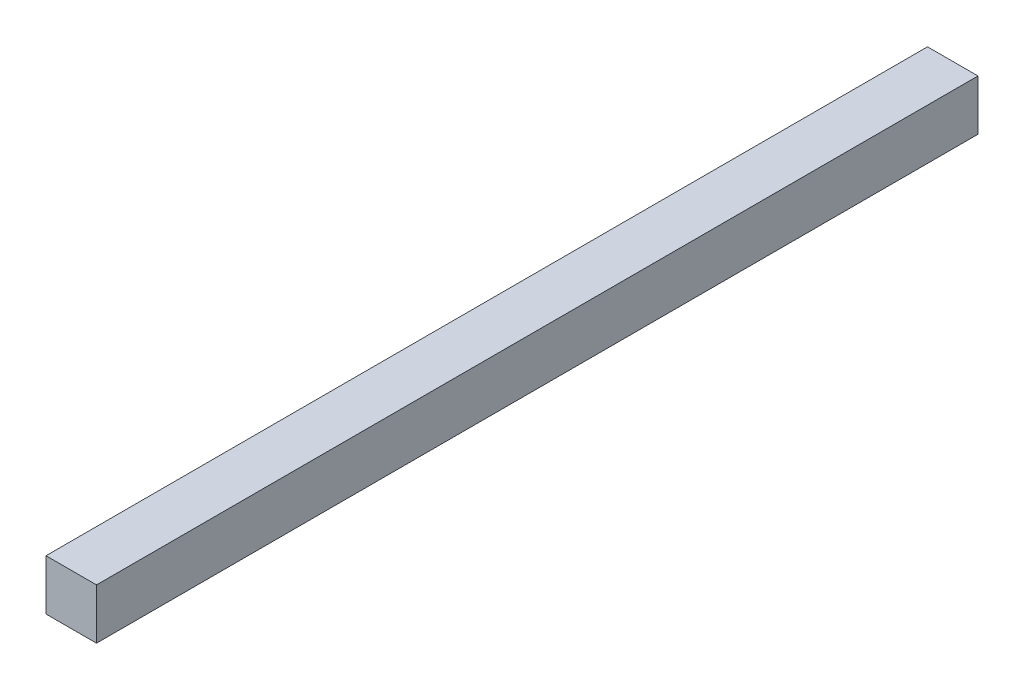
ISO-10303-21;
HEADER;
FILE_DESCRIPTION(('STEP AP214'),'2;1');
FILE_NAME('part.step','',(''),(''),'','','');
FILE_SCHEMA(('AUTOMOTIVE_DESIGN { 1 0 10303 214 1 1 1 1 }'));
ENDSEC;
DATA;
#1=APPLICATION_CONTEXT('core data for automotive mechanical design processes');
#2=APPLICATION_PROTOCOL_DEFINITION('international standard','automotive_design',2000,#1);
#3=PRODUCT_CONTEXT('',#1,'mechanical');
#4=PRODUCT('Part','Part','',(#3));
#5=PRODUCT_RELATED_PRODUCT_CATEGORY('part','',(#4));
#6=PRODUCT_DEFINITION_FORMATION('','',#4);
#7=PRODUCT_DEFINITION_CONTEXT('part definition',#1,'design');
#8=PRODUCT_DEFINITION('design','',#6,#7);
#9=PRODUCT_DEFINITION_SHAPE('','',#8);
#10=(LENGTH_UNIT() NAMED_UNIT(*) SI_UNIT(.MILLI.,.METRE.));
#11=(NAMED_UNIT(*) PLANE_ANGLE_UNIT() SI_UNIT($,.RADIAN.));
#12=(NAMED_UNIT(*) SI_UNIT($,.STERADIAN.) SOLID_ANGLE_UNIT());
#13=UNCERTAINTY_MEASURE_WITH_UNIT(LENGTH_MEASURE(1.E-05),#10,'distance_accuracy_value','');
#14=(GEOMETRIC_REPRESENTATION_CONTEXT(3) GLOBAL_UNCERTAINTY_ASSIGNED_CONTEXT((#13)) GLOBAL_UNIT_ASSIGNED_CONTEXT((#10,
#11,#12)) REPRESENTATION_CONTEXT('',''));
#15=CARTESIAN_POINT('',(0.,0.,0.));
#16=DIRECTION('',(0.,0.,1.));
#17=DIRECTION('',(1.,0.,0.));
#18=AXIS2_PLACEMENT_3D('',#15,#16,#17);
#19=CARTESIAN_POINT('',(-17.4625,17.4625,609.6));
#20=DIRECTION('',(1.,0.,0.));
#21=DIRECTION('',(0.,0.,-1.));
#22=AXIS2_PLACEMENT_3D('',#19,#20,#21);
#23=PLANE('',#22);
#24=DIRECTION('',(0.,-1.,0.));
#25=VECTOR('',#24,1.);
#26=CARTESIAN_POINT('',(-17.4625,17.4625,0.));
#27=LINE('',#26,#25);
#28=CARTESIAN_POINT('',(-17.4625,17.4625,0.));
#29=VERTEX_POINT('',#28);
#30=CARTESIAN_POINT('',(-17.4625,-17.4625,0.));
#31=VERTEX_POINT('',#30);
#32=EDGE_CURVE('E100',#29,#31,#27,.T.);
#33=ORIENTED_EDGE('',*,*,#32,.T.);
#34=DIRECTION('',(0.,0.,-1.));
#35=VECTOR('',#34,1.);
#36=CARTESIAN_POINT('',(-17.4625,-17.4625,609.6));
#37=LINE('',#36,#35);
#38=CARTESIAN_POINT('',(-17.4625,-17.4625,609.6));
#39=VERTEX_POINT('',#38);
#40=EDGE_CURVE('E11',#39,#31,#37,.T.);
#41=ORIENTED_EDGE('',*,*,#40,.F.);
#42=DIRECTION('',(0.,-1.,0.));
#43=VECTOR('',#42,1.);
#44=CARTESIAN_POINT('',(-17.4625,17.4625,609.6));
#45=LINE('',#44,#43);
#46=CARTESIAN_POINT('',(-17.4625,17.4625,609.6));
#47=VERTEX_POINT('',#46);
#48=EDGE_CURVE('E88',#47,#39,#45,.T.);
#49=ORIENTED_EDGE('',*,*,#48,.F.);
#50=DIRECTION('',(0.,0.,-1.));
#51=VECTOR('',#50,1.);
#52=CARTESIAN_POINT('',(-17.4625,17.4625,609.6));
#53=LINE('',#52,#51);
#54=EDGE_CURVE('E96',#47,#29,#53,.T.);
#55=ORIENTED_EDGE('',*,*,#54,.T.);
#56=EDGE_LOOP('',(#33,#41,#49,#55));
#57=FACE_BOUND('',#56,.T.);
#58=ADVANCED_FACE('F37',(#57),#23,.F.);
#59=CARTESIAN_POINT('',(17.4625,-17.4625,609.6));
#60=DIRECTION('',(0.,1.,0.));
#61=DIRECTION('',(0.,0.,1.));
#62=AXIS2_PLACEMENT_3D('',#59,#60,#61);
#63=PLANE('',#62);
#64=DIRECTION('',(1.,0.,0.));
#65=VECTOR('',#64,1.);
#66=CARTESIAN_POINT('',(17.4625,-17.4625,0.));
#67=LINE('',#66,#65);
#68=CARTESIAN_POINT('',(17.4625,-17.4625,0.));
#69=VERTEX_POINT('',#68);
#70=EDGE_CURVE('E92',#31,#69,#67,.T.);
#71=ORIENTED_EDGE('',*,*,#70,.T.);
#72=DIRECTION('',(0.,0.,-1.));
#73=VECTOR('',#72,1.);
#74=CARTESIAN_POINT('',(17.4625,-17.4625,609.6));
#75=LINE('',#74,#73);
#76=CARTESIAN_POINT('',(17.4625,-17.4625,609.6));
#77=VERTEX_POINT('',#76);
#78=EDGE_CURVE('E45',#77,#69,#75,.T.);
#79=ORIENTED_EDGE('',*,*,#78,.F.);
#80=DIRECTION('',(1.,0.,0.));
#81=VECTOR('',#80,1.);
#82=CARTESIAN_POINT('',(17.4625,-17.4625,609.6));
#83=LINE('',#82,#81);
#84=EDGE_CURVE('E83',#39,#77,#83,.T.);
#85=ORIENTED_EDGE('',*,*,#84,.F.);
#86=ORIENTED_EDGE('',*,*,#40,.T.);
#87=EDGE_LOOP('',(#71,#79,#85,#86));
#88=FACE_BOUND('',#87,.T.);
#89=ADVANCED_FACE('F91',(#88),#63,.F.);
#90=CARTESIAN_POINT('',(17.4625,17.4625,609.6));
#91=DIRECTION('',(-1.,0.,0.));
#92=DIRECTION('',(0.,0.,1.));
#93=AXIS2_PLACEMENT_3D('',#90,#91,#92);
#94=PLANE('',#93);
#95=DIRECTION('',(0.,1.,0.));
#96=VECTOR('',#95,1.);
#97=CARTESIAN_POINT('',(17.4625,17.4625,0.));
#98=LINE('',#97,#96);
#99=CARTESIAN_POINT('',(17.4625,17.4625,0.));
#100=VERTEX_POINT('',#99);
#101=EDGE_CURVE('E70',#69,#100,#98,.T.);
#102=ORIENTED_EDGE('',*,*,#101,.T.);
#103=DIRECTION('',(0.,0.,-1.));
#104=VECTOR('',#103,1.);
#105=CARTESIAN_POINT('',(17.4625,17.4625,609.6));
#106=LINE('',#105,#104);
#107=CARTESIAN_POINT('',(17.4625,17.4625,609.6));
#108=VERTEX_POINT('',#107);
#109=EDGE_CURVE('E93',#108,#100,#106,.T.);
#110=ORIENTED_EDGE('',*,*,#109,.F.);
#111=DIRECTION('',(0.,1.,0.));
#112=VECTOR('',#111,1.);
#113=CARTESIAN_POINT('',(17.4625,17.4625,609.6));
#114=LINE('',#113,#112);
#115=EDGE_CURVE('E86',#77,#108,#114,.T.);
#116=ORIENTED_EDGE('',*,*,#115,.F.);
#117=ORIENTED_EDGE('',*,*,#78,.T.);
#118=EDGE_LOOP('',(#102,#110,#116,#117));
#119=FACE_BOUND('',#118,.T.);
#120=ADVANCED_FACE('F94',(#119),#94,.F.);
#121=CARTESIAN_POINT('',(17.4625,17.4625,609.6));
#122=DIRECTION('',(0.,-1.,0.));
#123=DIRECTION('',(0.,0.,-1.));
#124=AXIS2_PLACEMENT_3D('',#121,#122,#123);
#125=PLANE('',#124);
#126=DIRECTION('',(-1.,0.,0.));
#127=VECTOR('',#126,1.);
#128=CARTESIAN_POINT('',(17.4625,17.4625,0.));
#129=LINE('',#128,#127);
#130=EDGE_CURVE('E76',#100,#29,#129,.T.);
#131=ORIENTED_EDGE('',*,*,#130,.T.);
#132=ORIENTED_EDGE('',*,*,#54,.F.);
#133=DIRECTION('',(-1.,0.,0.));
#134=VECTOR('',#133,1.);
#135=CARTESIAN_POINT('',(17.4625,17.4625,609.6));
#136=LINE('',#135,#134);
#137=EDGE_CURVE('E53',#108,#47,#136,.T.);
#138=ORIENTED_EDGE('',*,*,#137,.F.);
#139=ORIENTED_EDGE('',*,*,#109,.T.);
#140=EDGE_LOOP('',(#131,#132,#138,#139));
#141=FACE_BOUND('',#140,.T.);
#142=ADVANCED_FACE('F107',(#141),#125,.F.);
#143=CARTESIAN_POINT('',(0.,0.,609.6));
#144=DIRECTION('',(0.,0.,-1.));
#145=DIRECTION('',(-1.,0.,0.));
#146=AXIS2_PLACEMENT_3D('',#143,#144,#145);
#147=PLANE('',#146);
#148=ORIENTED_EDGE('',*,*,#48,.T.);
#149=ORIENTED_EDGE('',*,*,#84,.T.);
#150=ORIENTED_EDGE('',*,*,#115,.T.);
#151=ORIENTED_EDGE('',*,*,#137,.T.);
#152=EDGE_LOOP('',(#148,#149,#150,#151));
#153=FACE_BOUND('',#152,.T.);
#154=ADVANCED_FACE('F84',(#153),#147,.F.);
#155=CARTESIAN_POINT('',(0.,0.,0.));
#156=DIRECTION('',(0.,0.,-1.));
#157=DIRECTION('',(-1.,0.,0.));
#158=AXIS2_PLACEMENT_3D('',#155,#156,#157);
#159=PLANE('',#158);
#160=ORIENTED_EDGE('',*,*,#32,.F.);
#161=ORIENTED_EDGE('',*,*,#130,.F.);
#162=ORIENTED_EDGE('',*,*,#101,.F.);
#163=ORIENTED_EDGE('',*,*,#70,.F.);
#164=EDGE_LOOP('',(#160,#161,#162,#163));
#165=FACE_BOUND('',#164,.T.);
#166=ADVANCED_FACE('F110',(#165),#159,.T.);
#167=CLOSED_SHELL('',(#58,#89,#120,#142,#154,#166));
#168=MANIFOLD_SOLID_BREP('B2',#167);
#169=ADVANCED_BREP_SHAPE_REPRESENTATION('',(#18,#168),#14);
#170=SHAPE_DEFINITION_REPRESENTATION(#9,#169);
ENDSEC;
END-ISO-10303-21;
